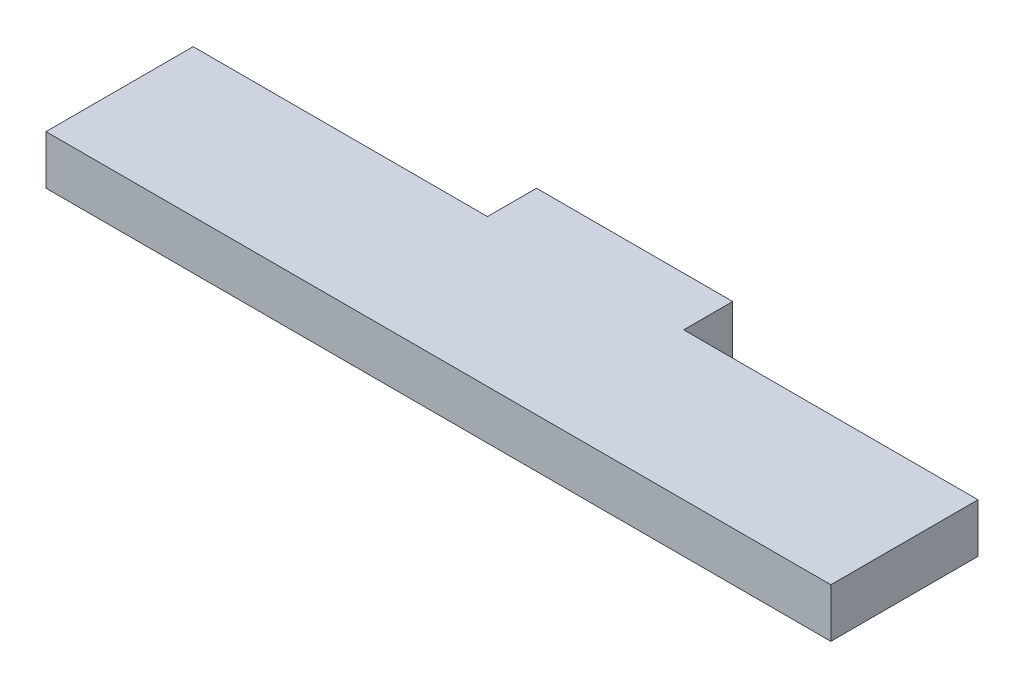
ISO-10303-21;
HEADER;
FILE_DESCRIPTION(('STEP AP214'),'2;1');
FILE_NAME('part.step','',(''),(''),'','','');
FILE_SCHEMA(('AUTOMOTIVE_DESIGN { 1 0 10303 214 1 1 1 1 }'));
ENDSEC;
DATA;
#1=APPLICATION_CONTEXT('core data for automotive mechanical design processes');
#2=APPLICATION_PROTOCOL_DEFINITION('international standard','automotive_design',2000,#1);
#3=PRODUCT_CONTEXT('',#1,'mechanical');
#4=PRODUCT('Part','Part','',(#3));
#5=PRODUCT_RELATED_PRODUCT_CATEGORY('part','',(#4));
#6=PRODUCT_DEFINITION_FORMATION('','',#4);
#7=PRODUCT_DEFINITION_CONTEXT('part definition',#1,'design');
#8=PRODUCT_DEFINITION('design','',#6,#7);
#9=PRODUCT_DEFINITION_SHAPE('','',#8);
#10=(LENGTH_UNIT() NAMED_UNIT(*) SI_UNIT(.MILLI.,.METRE.));
#11=(NAMED_UNIT(*) PLANE_ANGLE_UNIT() SI_UNIT($,.RADIAN.));
#12=(NAMED_UNIT(*) SI_UNIT($,.STERADIAN.) SOLID_ANGLE_UNIT());
#13=UNCERTAINTY_MEASURE_WITH_UNIT(LENGTH_MEASURE(1.E-05),#10,'distance_accuracy_value','');
#14=(GEOMETRIC_REPRESENTATION_CONTEXT(3) GLOBAL_UNCERTAINTY_ASSIGNED_CONTEXT((#13)) GLOBAL_UNIT_ASSIGNED_CONTEXT((#10,
#11,#12)) REPRESENTATION_CONTEXT('',''));
#15=CARTESIAN_POINT('',(0.,0.,0.));
#16=DIRECTION('',(0.,0.,1.));
#17=DIRECTION('',(1.,0.,0.));
#18=AXIS2_PLACEMENT_3D('',#15,#16,#17);
#19=CARTESIAN_POINT('',(-21.1425003959114,6.35,-19.05));
#20=DIRECTION('',(1.,0.,0.));
#21=DIRECTION('',(0.,0.,-1.));
#22=AXIS2_PLACEMENT_3D('',#19,#20,#21);
#23=PLANE('',#22);
#24=DIRECTION('',(0.,0.,1.));
#25=VECTOR('',#24,1.);
#26=CARTESIAN_POINT('',(-21.1425003959114,6.35,-19.05));
#27=LINE('',#26,#25);
#28=CARTESIAN_POINT('',(-21.1425003959114,6.35,-12.7));
#29=VERTEX_POINT('',#28);
#30=CARTESIAN_POINT('',(-21.1425003959114,6.35,6.35));
#31=VERTEX_POINT('',#30);
#32=EDGE_CURVE('E112',#29,#31,#27,.T.);
#33=ORIENTED_EDGE('',*,*,#32,.F.);
#34=DIRECTION('',(0.,1.,0.));
#35=VECTOR('',#34,1.);
#36=CARTESIAN_POINT('',(-21.1425003959114,0.,-12.7));
#37=LINE('',#36,#35);
#38=CARTESIAN_POINT('',(-21.1425003959114,0.,-12.7));
#39=VERTEX_POINT('',#38);
#40=EDGE_CURVE('E100',#39,#29,#37,.T.);
#41=ORIENTED_EDGE('',*,*,#40,.F.);
#42=DIRECTION('',(0.,0.,1.));
#43=VECTOR('',#42,1.);
#44=CARTESIAN_POINT('',(-21.1425003959114,0.,-19.05));
#45=LINE('',#44,#43);
#46=CARTESIAN_POINT('',(-21.1425003959114,0.,6.35));
#47=VERTEX_POINT('',#46);
#48=EDGE_CURVE('E110',#39,#47,#45,.T.);
#49=ORIENTED_EDGE('',*,*,#48,.T.);
#50=DIRECTION('',(0.,-1.,0.));
#51=VECTOR('',#50,1.);
#52=CARTESIAN_POINT('',(-21.1425003959114,6.35,6.35));
#53=LINE('',#52,#51);
#54=EDGE_CURVE('E11',#31,#47,#53,.T.);
#55=ORIENTED_EDGE('',*,*,#54,.F.);
#56=EDGE_LOOP('',(#33,#41,#49,#55));
#57=FACE_BOUND('',#56,.T.);
#58=ADVANCED_FACE('F32',(#57),#23,.F.);
#59=CARTESIAN_POINT('',(-21.1425003959114,6.35,6.35));
#60=DIRECTION('',(0.,0.,-1.));
#61=DIRECTION('',(-1.,0.,0.));
#62=AXIS2_PLACEMENT_3D('',#59,#60,#61);
#63=PLANE('',#62);
#64=DIRECTION('',(1.,0.,0.));
#65=VECTOR('',#64,1.);
#66=CARTESIAN_POINT('',(-21.1425003959114,0.,6.35));
#67=LINE('',#66,#65);
#68=CARTESIAN_POINT('',(80.4574996040886,0.,6.35));
#69=VERTEX_POINT('',#68);
#70=EDGE_CURVE('E116',#47,#69,#67,.T.);
#71=ORIENTED_EDGE('',*,*,#70,.T.);
#72=DIRECTION('',(0.,-1.,0.));
#73=VECTOR('',#72,1.);
#74=CARTESIAN_POINT('',(80.4574996040886,6.35,6.35));
#75=LINE('',#74,#73);
#76=CARTESIAN_POINT('',(80.4574996040886,6.35,6.35));
#77=VERTEX_POINT('',#76);
#78=EDGE_CURVE('E39',#77,#69,#75,.T.);
#79=ORIENTED_EDGE('',*,*,#78,.F.);
#80=DIRECTION('',(1.,0.,0.));
#81=VECTOR('',#80,1.);
#82=CARTESIAN_POINT('',(-21.1425003959114,6.35,6.35));
#83=LINE('',#82,#81);
#84=EDGE_CURVE('E142',#31,#77,#83,.T.);
#85=ORIENTED_EDGE('',*,*,#84,.F.);
#86=ORIENTED_EDGE('',*,*,#54,.T.);
#87=EDGE_LOOP('',(#71,#79,#85,#86));
#88=FACE_BOUND('',#87,.T.);
#89=ADVANCED_FACE('F176',(#88),#63,.F.);
#90=CARTESIAN_POINT('',(80.4574996040886,6.35,-19.05));
#91=DIRECTION('',(-1.,0.,0.));
#92=DIRECTION('',(0.,0.,1.));
#93=AXIS2_PLACEMENT_3D('',#90,#91,#92);
#94=PLANE('',#93);
#95=DIRECTION('',(0.,0.,-1.));
#96=VECTOR('',#95,1.);
#97=CARTESIAN_POINT('',(80.4574996040886,0.,-19.05));
#98=LINE('',#97,#96);
#99=CARTESIAN_POINT('',(80.4574996040886,0.,-12.7));
#100=VERTEX_POINT('',#99);
#101=EDGE_CURVE('E119',#69,#100,#98,.T.);
#102=ORIENTED_EDGE('',*,*,#101,.T.);
#103=DIRECTION('',(0.,1.,0.));
#104=VECTOR('',#103,1.);
#105=CARTESIAN_POINT('',(80.4574996040886,0.,-12.7));
#106=LINE('',#105,#104);
#107=CARTESIAN_POINT('',(80.4574996040886,6.35,-12.7));
#108=VERTEX_POINT('',#107);
#109=EDGE_CURVE('E54',#100,#108,#106,.T.);
#110=ORIENTED_EDGE('',*,*,#109,.T.);
#111=DIRECTION('',(0.,0.,-1.));
#112=VECTOR('',#111,1.);
#113=CARTESIAN_POINT('',(80.4574996040886,6.35,-19.05));
#114=LINE('',#113,#112);
#115=EDGE_CURVE('E136',#77,#108,#114,.T.);
#116=ORIENTED_EDGE('',*,*,#115,.F.);
#117=ORIENTED_EDGE('',*,*,#78,.T.);
#118=EDGE_LOOP('',(#102,#110,#116,#117));
#119=FACE_BOUND('',#118,.T.);
#120=ADVANCED_FACE('F174',(#119),#94,.F.);
#121=CARTESIAN_POINT('',(-21.1425003959114,6.35,-19.05));
#122=DIRECTION('',(0.,0.,1.));
#123=DIRECTION('',(1.,0.,0.));
#124=AXIS2_PLACEMENT_3D('',#121,#122,#123);
#125=PLANE('',#124);
#126=DIRECTION('',(-1.,0.,0.));
#127=VECTOR('',#126,1.);
#128=CARTESIAN_POINT('',(-21.1425003959114,0.,-19.05));
#129=LINE('',#128,#127);
#130=CARTESIAN_POINT('',(42.3574996040886,0.,-19.05));
#131=VERTEX_POINT('',#130);
#132=CARTESIAN_POINT('',(16.9574996040886,0.,-19.05));
#133=VERTEX_POINT('',#132);
#134=EDGE_CURVE('E129',#131,#133,#129,.T.);
#135=ORIENTED_EDGE('',*,*,#134,.T.);
#136=DIRECTION('',(0.,1.,0.));
#137=VECTOR('',#136,1.);
#138=CARTESIAN_POINT('',(16.9574996040886,0.,-19.05));
#139=LINE('',#138,#137);
#140=CARTESIAN_POINT('',(16.9574996040886,6.35,-19.05));
#141=VERTEX_POINT('',#140);
#142=EDGE_CURVE('E152',#133,#141,#139,.T.);
#143=ORIENTED_EDGE('',*,*,#142,.T.);
#144=DIRECTION('',(-1.,0.,0.));
#145=VECTOR('',#144,1.);
#146=CARTESIAN_POINT('',(-21.1425003959114,6.35,-19.05));
#147=LINE('',#146,#145);
#148=CARTESIAN_POINT('',(42.3574996040886,6.35,-19.05));
#149=VERTEX_POINT('',#148);
#150=EDGE_CURVE('E124',#149,#141,#147,.T.);
#151=ORIENTED_EDGE('',*,*,#150,.F.);
#152=DIRECTION('',(0.,1.,0.));
#153=VECTOR('',#152,1.);
#154=CARTESIAN_POINT('',(42.3574996040886,0.,-19.05));
#155=LINE('',#154,#153);
#156=EDGE_CURVE('E105',#131,#149,#155,.T.);
#157=ORIENTED_EDGE('',*,*,#156,.F.);
#158=EDGE_LOOP('',(#135,#143,#151,#157));
#159=FACE_BOUND('',#158,.T.);
#160=ADVANCED_FACE('F169',(#159),#125,.F.);
#161=CARTESIAN_POINT('',(0.,6.35,0.));
#162=DIRECTION('',(0.,1.,0.));
#163=DIRECTION('',(0.,0.,1.));
#164=AXIS2_PLACEMENT_3D('',#161,#162,#163);
#165=PLANE('',#164);
#166=DIRECTION('',(0.,0.,-1.));
#167=VECTOR('',#166,1.);
#168=CARTESIAN_POINT('',(16.9574996040886,6.35,0.));
#169=LINE('',#168,#167);
#170=CARTESIAN_POINT('',(16.9574996040886,6.35,-12.7));
#171=VERTEX_POINT('',#170);
#172=EDGE_CURVE('E117',#171,#141,#169,.T.);
#173=ORIENTED_EDGE('',*,*,#172,.F.);
#174=DIRECTION('',(1.,0.,0.));
#175=VECTOR('',#174,1.);
#176=CARTESIAN_POINT('',(0.,6.35,-12.7));
#177=LINE('',#176,#175);
#178=EDGE_CURVE('E121',#29,#171,#177,.T.);
#179=ORIENTED_EDGE('',*,*,#178,.F.);
#180=ORIENTED_EDGE('',*,*,#32,.T.);
#181=ORIENTED_EDGE('',*,*,#84,.T.);
#182=ORIENTED_EDGE('',*,*,#115,.T.);
#183=DIRECTION('',(1.,0.,0.));
#184=VECTOR('',#183,1.);
#185=CARTESIAN_POINT('',(0.,6.35,-12.7));
#186=LINE('',#185,#184);
#187=CARTESIAN_POINT('',(42.3574996040886,6.35,-12.7));
#188=VERTEX_POINT('',#187);
#189=EDGE_CURVE('E150',#188,#108,#186,.T.);
#190=ORIENTED_EDGE('',*,*,#189,.F.);
#191=DIRECTION('',(0.,0.,1.));
#192=VECTOR('',#191,1.);
#193=CARTESIAN_POINT('',(42.3574996040886,6.35,0.));
#194=LINE('',#193,#192);
#195=EDGE_CURVE('E148',#149,#188,#194,.T.);
#196=ORIENTED_EDGE('',*,*,#195,.F.);
#197=ORIENTED_EDGE('',*,*,#150,.T.);
#198=EDGE_LOOP('',(#173,#179,#180,#181,#182,#190,#196,#197));
#199=FACE_BOUND('',#198,.T.);
#200=ADVANCED_FACE('F172',(#199),#165,.T.);
#201=CARTESIAN_POINT('',(0.,0.,0.));
#202=DIRECTION('',(0.,1.,0.));
#203=DIRECTION('',(0.,0.,1.));
#204=AXIS2_PLACEMENT_3D('',#201,#202,#203);
#205=PLANE('',#204);
#206=DIRECTION('',(1.,0.,0.));
#207=VECTOR('',#206,1.);
#208=CARTESIAN_POINT('',(-21.1425003959114,0.,-12.7));
#209=LINE('',#208,#207);
#210=CARTESIAN_POINT('',(16.9574996040886,0.,-12.7));
#211=VERTEX_POINT('',#210);
#212=EDGE_CURVE('E97',#39,#211,#209,.T.);
#213=ORIENTED_EDGE('',*,*,#212,.T.);
#214=DIRECTION('',(0.,0.,-1.));
#215=VECTOR('',#214,1.);
#216=CARTESIAN_POINT('',(16.9574996040886,0.,-19.05));
#217=LINE('',#216,#215);
#218=EDGE_CURVE('E46',#211,#133,#217,.T.);
#219=ORIENTED_EDGE('',*,*,#218,.T.);
#220=ORIENTED_EDGE('',*,*,#134,.F.);
#221=DIRECTION('',(0.,0.,1.));
#222=VECTOR('',#221,1.);
#223=CARTESIAN_POINT('',(42.3574996040886,0.,-19.05));
#224=LINE('',#223,#222);
#225=CARTESIAN_POINT('',(42.3574996040886,0.,-12.7));
#226=VERTEX_POINT('',#225);
#227=EDGE_CURVE('E160',#131,#226,#224,.T.);
#228=ORIENTED_EDGE('',*,*,#227,.T.);
#229=DIRECTION('',(1.,0.,0.));
#230=VECTOR('',#229,1.);
#231=CARTESIAN_POINT('',(42.3574996040886,0.,-12.7));
#232=LINE('',#231,#230);
#233=EDGE_CURVE('E156',#226,#100,#232,.T.);
#234=ORIENTED_EDGE('',*,*,#233,.T.);
#235=ORIENTED_EDGE('',*,*,#101,.F.);
#236=ORIENTED_EDGE('',*,*,#70,.F.);
#237=ORIENTED_EDGE('',*,*,#48,.F.);
#238=EDGE_LOOP('',(#213,#219,#220,#228,#234,#235,#236,#237));
#239=FACE_BOUND('',#238,.T.);
#240=ADVANCED_FACE('F114',(#239),#205,.F.);
#241=CARTESIAN_POINT('',(42.3574996040886,0.,-19.05));
#242=DIRECTION('',(-1.,0.,0.));
#243=DIRECTION('',(0.,0.,1.));
#244=AXIS2_PLACEMENT_3D('',#241,#242,#243);
#245=PLANE('',#244);
#246=ORIENTED_EDGE('',*,*,#195,.T.);
#247=DIRECTION('',(0.,1.,0.));
#248=VECTOR('',#247,1.);
#249=CARTESIAN_POINT('',(42.3574996040886,0.,-12.7));
#250=LINE('',#249,#248);
#251=EDGE_CURVE('E153',#226,#188,#250,.T.);
#252=ORIENTED_EDGE('',*,*,#251,.F.);
#253=ORIENTED_EDGE('',*,*,#227,.F.);
#254=ORIENTED_EDGE('',*,*,#156,.T.);
#255=EDGE_LOOP('',(#246,#252,#253,#254));
#256=FACE_BOUND('',#255,.T.);
#257=ADVANCED_FACE('F171',(#256),#245,.F.);
#258=CARTESIAN_POINT('',(42.3574996040886,0.,-12.7));
#259=DIRECTION('',(0.,0.,1.));
#260=DIRECTION('',(1.,0.,0.));
#261=AXIS2_PLACEMENT_3D('',#258,#259,#260);
#262=PLANE('',#261);
#263=ORIENTED_EDGE('',*,*,#189,.T.);
#264=ORIENTED_EDGE('',*,*,#109,.F.);
#265=ORIENTED_EDGE('',*,*,#233,.F.);
#266=ORIENTED_EDGE('',*,*,#251,.T.);
#267=EDGE_LOOP('',(#263,#264,#265,#266));
#268=FACE_BOUND('',#267,.T.);
#269=ADVANCED_FACE('F173',(#268),#262,.F.);
#270=CARTESIAN_POINT('',(16.9574996040886,0.,-19.05));
#271=DIRECTION('',(1.,0.,0.));
#272=DIRECTION('',(0.,0.,-1.));
#273=AXIS2_PLACEMENT_3D('',#270,#271,#272);
#274=PLANE('',#273);
#275=ORIENTED_EDGE('',*,*,#172,.T.);
#276=ORIENTED_EDGE('',*,*,#142,.F.);
#277=ORIENTED_EDGE('',*,*,#218,.F.);
#278=DIRECTION('',(0.,1.,0.));
#279=VECTOR('',#278,1.);
#280=CARTESIAN_POINT('',(16.9574996040886,0.,-12.7));
#281=LINE('',#280,#279);
#282=EDGE_CURVE('E102',#211,#171,#281,.T.);
#283=ORIENTED_EDGE('',*,*,#282,.T.);
#284=EDGE_LOOP('',(#275,#276,#277,#283));
#285=FACE_BOUND('',#284,.T.);
#286=ADVANCED_FACE('F233',(#285),#274,.F.);
#287=CARTESIAN_POINT('',(-21.1425003959114,0.,-12.7));
#288=DIRECTION('',(0.,0.,1.));
#289=DIRECTION('',(1.,0.,0.));
#290=AXIS2_PLACEMENT_3D('',#287,#288,#289);
#291=PLANE('',#290);
#292=ORIENTED_EDGE('',*,*,#178,.T.);
#293=ORIENTED_EDGE('',*,*,#282,.F.);
#294=ORIENTED_EDGE('',*,*,#212,.F.);
#295=ORIENTED_EDGE('',*,*,#40,.T.);
#296=EDGE_LOOP('',(#292,#293,#294,#295));
#297=FACE_BOUND('',#296,.T.);
#298=ADVANCED_FACE('F99',(#297),#291,.F.);
#299=CLOSED_SHELL('',(#58,#89,#120,#160,#200,#240,#257,#269,#286,#298));
#300=MANIFOLD_SOLID_BREP('B2',#299);
#301=ADVANCED_BREP_SHAPE_REPRESENTATION('',(#18,#300),#14);
#302=SHAPE_DEFINITION_REPRESENTATION(#9,#301);
ENDSEC;
END-ISO-10303-21;
